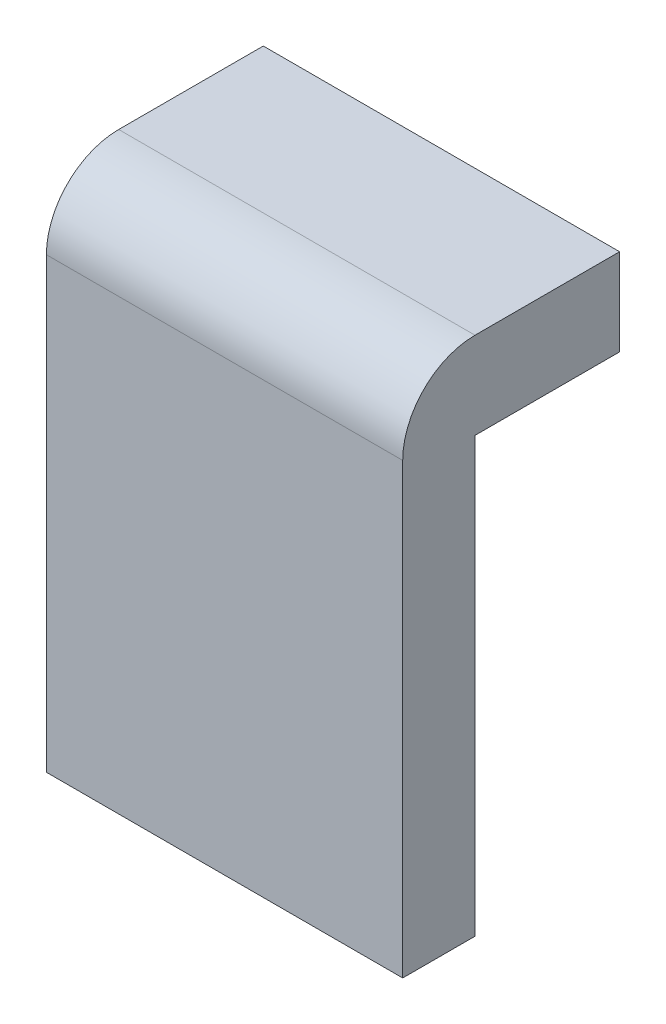
ISO-10303-21;
HEADER;
FILE_DESCRIPTION(('STEP AP214'),'2;1');
FILE_NAME('part.step','',(''),(''),'','','');
FILE_SCHEMA(('AUTOMOTIVE_DESIGN { 1 0 10303 214 1 1 1 1 }'));
ENDSEC;
DATA;
#1=APPLICATION_CONTEXT('core data for automotive mechanical design processes');
#2=APPLICATION_PROTOCOL_DEFINITION('international standard','automotive_design',2000,#1);
#3=PRODUCT_CONTEXT('',#1,'mechanical');
#4=PRODUCT('Part','Part','',(#3));
#5=PRODUCT_RELATED_PRODUCT_CATEGORY('part','',(#4));
#6=PRODUCT_DEFINITION_FORMATION('','',#4);
#7=PRODUCT_DEFINITION_CONTEXT('part definition',#1,'design');
#8=PRODUCT_DEFINITION('design','',#6,#7);
#9=PRODUCT_DEFINITION_SHAPE('','',#8);
#10=(LENGTH_UNIT() NAMED_UNIT(*) SI_UNIT(.MILLI.,.METRE.));
#11=(NAMED_UNIT(*) PLANE_ANGLE_UNIT() SI_UNIT($,.RADIAN.));
#12=(NAMED_UNIT(*) SI_UNIT($,.STERADIAN.) SOLID_ANGLE_UNIT());
#13=UNCERTAINTY_MEASURE_WITH_UNIT(LENGTH_MEASURE(1.E-05),#10,'distance_accuracy_value','');
#14=(GEOMETRIC_REPRESENTATION_CONTEXT(3) GLOBAL_UNCERTAINTY_ASSIGNED_CONTEXT((#13)) GLOBAL_UNIT_ASSIGNED_CONTEXT((#10,
#11,#12)) REPRESENTATION_CONTEXT('',''));
#15=CARTESIAN_POINT('',(0.,0.,0.));
#16=DIRECTION('',(0.,0.,1.));
#17=DIRECTION('',(1.,0.,0.));
#18=AXIS2_PLACEMENT_3D('',#15,#16,#17);
#19=CARTESIAN_POINT('',(-8.34906661620967,8.30000000000001,12.2546737770755));
#20=DIRECTION('',(0.,0.,1.));
#21=DIRECTION('',(0.,-1.,0.));
#22=AXIS2_PLACEMENT_3D('',#19,#20,#21);
#23=PLANE('',#22);
#24=DIRECTION('',(1.,0.,0.));
#25=VECTOR('',#24,1.);
#26=CARTESIAN_POINT('',(-15.8147962412963,6.80000000000003,12.2546737770755));
#27=LINE('',#26,#25);
#28=CARTESIAN_POINT('',(9.16373951271684,6.80000000000003,12.2546737770755));
#29=VERTEX_POINT('',#28);
#30=CARTESIAN_POINT('',(10.3958902691576,6.80000000000003,12.2546737770755));
#31=VERTEX_POINT('',#30);
#32=EDGE_CURVE('E113',#29,#31,#27,.T.);
#33=ORIENTED_EDGE('',*,*,#32,.F.);
#34=DIRECTION('',(0.,1.,0.));
#35=VECTOR('',#34,1.);
#36=CARTESIAN_POINT('',(9.16373951271684,5.35753839337147,12.2546737770755));
#37=LINE('',#36,#35);
#38=CARTESIAN_POINT('',(9.16373951271684,8.30000000000001,12.2546737770755));
#39=VERTEX_POINT('',#38);
#40=EDGE_CURVE('E148',#39,#29,#37,.F.);
#41=ORIENTED_EDGE('',*,*,#40,.F.);
#42=DIRECTION('',(1.,0.,0.));
#43=VECTOR('',#42,1.);
#44=CARTESIAN_POINT('',(-8.34906661620967,8.30000000000001,12.2546737770755));
#45=LINE('',#44,#43);
#46=CARTESIAN_POINT('',(10.3958902691576,8.30000000000001,12.2546737770755));
#47=VERTEX_POINT('',#46);
#48=EDGE_CURVE('E133',#39,#47,#45,.T.);
#49=ORIENTED_EDGE('',*,*,#48,.T.);
#50=DIRECTION('',(0.,1.,0.));
#51=VECTOR('',#50,1.);
#52=CARTESIAN_POINT('',(10.3958902691576,5.35753839337147,12.2546737770755));
#53=LINE('',#52,#51);
#54=EDGE_CURVE('E105',#31,#47,#53,.T.);
#55=ORIENTED_EDGE('',*,*,#54,.F.);
#56=EDGE_LOOP('',(#33,#41,#49,#55));
#57=FACE_BOUND('',#56,.T.);
#58=ADVANCED_FACE('F17',(#57),#23,.F.);
#59=CARTESIAN_POINT('',(-8.34906661620967,8.30000000000001,11.7546737770755));
#60=DIRECTION('',(0.,1.,0.));
#61=DIRECTION('',(0.,0.,1.));
#62=AXIS2_PLACEMENT_3D('',#59,#60,#61);
#63=PLANE('',#62);
#64=ORIENTED_EDGE('',*,*,#48,.F.);
#65=DIRECTION('',(0.,0.,1.));
#66=VECTOR('',#65,1.);
#67=CARTESIAN_POINT('',(9.16373951271684,8.30000000000001,12.5046737770755));
#68=LINE('',#67,#66);
#69=CARTESIAN_POINT('',(9.16373951271684,8.30000000000001,11.7546737770755));
#70=VERTEX_POINT('',#69);
#71=EDGE_CURVE('E153',#70,#39,#68,.T.);
#72=ORIENTED_EDGE('',*,*,#71,.F.);
#73=DIRECTION('',(1.,0.,0.));
#74=VECTOR('',#73,1.);
#75=CARTESIAN_POINT('',(9.16373951271684,8.30000000000001,11.7546737770755));
#76=LINE('',#75,#74);
#77=CARTESIAN_POINT('',(10.3958902691576,8.30000000000001,11.7546737770755));
#78=VERTEX_POINT('',#77);
#79=EDGE_CURVE('E124',#78,#70,#76,.F.);
#80=ORIENTED_EDGE('',*,*,#79,.F.);
#81=DIRECTION('',(0.,0.,-1.));
#82=VECTOR('',#81,1.);
#83=CARTESIAN_POINT('',(10.3958902691576,8.30000000000001,12.5046737770755));
#84=LINE('',#83,#82);
#85=EDGE_CURVE('E129',#47,#78,#84,.T.);
#86=ORIENTED_EDGE('',*,*,#85,.F.);
#87=EDGE_LOOP('',(#64,#72,#80,#86));
#88=FACE_BOUND('',#87,.T.);
#89=ADVANCED_FACE('F175',(#88),#63,.F.);
#90=CARTESIAN_POINT('',(9.16373951271684,5.35753839337146,11.7546737770755));
#91=DIRECTION('',(0.,0.,-1.));
#92=DIRECTION('',(0.,1.,0.));
#93=AXIS2_PLACEMENT_3D('',#90,#91,#92);
#94=PLANE('',#93);
#95=ORIENTED_EDGE('',*,*,#79,.T.);
#96=DIRECTION('',(0.,1.,0.));
#97=VECTOR('',#96,1.);
#98=CARTESIAN_POINT('',(9.16373951271684,5.35753839337147,11.7546737770755));
#99=LINE('',#98,#97);
#100=CARTESIAN_POINT('',(9.16373951271684,8.6,11.7546737770755));
#101=VERTEX_POINT('',#100);
#102=EDGE_CURVE('E119',#101,#70,#99,.F.);
#103=ORIENTED_EDGE('',*,*,#102,.F.);
#104=DIRECTION('',(1.,0.,0.));
#105=VECTOR('',#104,1.);
#106=CARTESIAN_POINT('',(-8.34906661620967,8.6,11.7546737770755));
#107=LINE('',#106,#105);
#108=CARTESIAN_POINT('',(10.3958902691576,8.6,11.7546737770755));
#109=VERTEX_POINT('',#108);
#110=EDGE_CURVE('E122',#101,#109,#107,.T.);
#111=ORIENTED_EDGE('',*,*,#110,.T.);
#112=DIRECTION('',(0.,1.,0.));
#113=VECTOR('',#112,1.);
#114=CARTESIAN_POINT('',(10.3958902691576,5.35753839337147,11.7546737770755));
#115=LINE('',#114,#113);
#116=EDGE_CURVE('E97',#78,#109,#115,.T.);
#117=ORIENTED_EDGE('',*,*,#116,.F.);
#118=EDGE_LOOP('',(#95,#103,#111,#117));
#119=FACE_BOUND('',#118,.T.);
#120=ADVANCED_FACE('F172',(#119),#94,.T.);
#121=CARTESIAN_POINT('',(-8.34906661620967,8.6,11.7546737770755));
#122=DIRECTION('',(0.,-1.,0.));
#123=DIRECTION('',(0.,0.,-1.));
#124=AXIS2_PLACEMENT_3D('',#121,#122,#123);
#125=PLANE('',#124);
#126=ORIENTED_EDGE('',*,*,#110,.F.);
#127=DIRECTION('',(0.,0.,1.));
#128=VECTOR('',#127,1.);
#129=CARTESIAN_POINT('',(9.16373951271684,8.6,12.5046737770755));
#130=LINE('',#129,#128);
#131=CARTESIAN_POINT('',(9.16373951271684,8.6,12.2546737770755));
#132=VERTEX_POINT('',#131);
#133=EDGE_CURVE('E83',#132,#101,#130,.F.);
#134=ORIENTED_EDGE('',*,*,#133,.F.);
#135=DIRECTION('',(1.,0.,0.));
#136=VECTOR('',#135,1.);
#137=CARTESIAN_POINT('',(-8.34906661620967,8.6,12.2546737770755));
#138=LINE('',#137,#136);
#139=CARTESIAN_POINT('',(10.3958902691576,8.6,12.2546737770755));
#140=VERTEX_POINT('',#139);
#141=EDGE_CURVE('E79',#140,#132,#138,.F.);
#142=ORIENTED_EDGE('',*,*,#141,.F.);
#143=DIRECTION('',(0.,0.,-1.));
#144=VECTOR('',#143,1.);
#145=CARTESIAN_POINT('',(10.3958902691576,8.6,12.5046737770755));
#146=LINE('',#145,#144);
#147=EDGE_CURVE('E94',#109,#140,#146,.F.);
#148=ORIENTED_EDGE('',*,*,#147,.F.);
#149=EDGE_LOOP('',(#126,#134,#142,#148));
#150=FACE_BOUND('',#149,.T.);
#151=ADVANCED_FACE('F168',(#150),#125,.F.);
#152=CARTESIAN_POINT('',(-8.34906661620967,8.35,12.2546737770755));
#153=DIRECTION('',(1.,0.,0.));
#154=DIRECTION('',(0.,0.,-1.));
#155=AXIS2_PLACEMENT_3D('',#152,#153,#154);
#156=CYLINDRICAL_SURFACE('',#155,0.249999999999995);
#157=CARTESIAN_POINT('',(9.16373951271684,8.35,12.2546737770755));
#158=DIRECTION('',(1.,0.,0.));
#159=DIRECTION('',(0.,0.,-1.));
#160=AXIS2_PLACEMENT_3D('',#157,#158,#159);
#161=CIRCLE('',#160,0.249999999999995);
#162=CARTESIAN_POINT('',(9.16373951271684,8.35,12.5046737770755));
#163=VERTEX_POINT('',#162);
#164=EDGE_CURVE('E20',#163,#132,#161,.F.);
#165=ORIENTED_EDGE('',*,*,#164,.F.);
#166=DIRECTION('',(1.,0.,0.));
#167=VECTOR('',#166,1.);
#168=CARTESIAN_POINT('',(9.16373951271684,8.35,12.5046737770755));
#169=LINE('',#168,#167);
#170=CARTESIAN_POINT('',(10.3958902691576,8.35,12.5046737770755));
#171=VERTEX_POINT('',#170);
#172=EDGE_CURVE('E77',#171,#163,#169,.F.);
#173=ORIENTED_EDGE('',*,*,#172,.F.);
#174=CARTESIAN_POINT('',(10.3958902691576,8.35,12.2546737770755));
#175=DIRECTION('',(1.,0.,0.));
#176=DIRECTION('',(0.,0.,-1.));
#177=AXIS2_PLACEMENT_3D('',#174,#175,#176);
#178=CIRCLE('',#177,0.249999999999995);
#179=EDGE_CURVE('E106',#140,#171,#178,.T.);
#180=ORIENTED_EDGE('',*,*,#179,.F.);
#181=ORIENTED_EDGE('',*,*,#141,.T.);
#182=EDGE_LOOP('',(#165,#173,#180,#181));
#183=FACE_BOUND('',#182,.T.);
#184=ADVANCED_FACE('F74',(#183),#156,.T.);
#185=CARTESIAN_POINT('',(9.16373951271684,5.35753839337147,12.5046737770755));
#186=DIRECTION('',(-1.,0.,0.));
#187=DIRECTION('',(0.,0.,1.));
#188=AXIS2_PLACEMENT_3D('',#185,#186,#187);
#189=PLANE('',#188);
#190=DIRECTION('',(0.,0.,-1.));
#191=VECTOR('',#190,1.);
#192=CARTESIAN_POINT('',(9.16373951271684,6.80000000000003,12.5046737770755));
#193=LINE('',#192,#191);
#194=CARTESIAN_POINT('',(9.16373951271684,6.80000000000003,12.5046737770755));
#195=VERTEX_POINT('',#194);
#196=EDGE_CURVE('E89',#195,#29,#193,.T.);
#197=ORIENTED_EDGE('',*,*,#196,.F.);
#198=DIRECTION('',(0.,-1.,0.));
#199=VECTOR('',#198,1.);
#200=CARTESIAN_POINT('',(9.16373951271684,5.35753839337147,12.5046737770755));
#201=LINE('',#200,#199);
#202=EDGE_CURVE('E85',#163,#195,#201,.T.);
#203=ORIENTED_EDGE('',*,*,#202,.F.);
#204=ORIENTED_EDGE('',*,*,#164,.T.);
#205=ORIENTED_EDGE('',*,*,#133,.T.);
#206=ORIENTED_EDGE('',*,*,#102,.T.);
#207=ORIENTED_EDGE('',*,*,#71,.T.);
#208=ORIENTED_EDGE('',*,*,#40,.T.);
#209=EDGE_LOOP('',(#197,#203,#204,#205,#206,#207,#208));
#210=FACE_BOUND('',#209,.T.);
#211=ADVANCED_FACE('F86',(#210),#189,.T.);
#212=CARTESIAN_POINT('',(-15.8147962412963,6.80000000000003,12.5046737770755));
#213=DIRECTION('',(0.,-1.,0.));
#214=DIRECTION('',(0.,0.,-1.));
#215=AXIS2_PLACEMENT_3D('',#212,#213,#214);
#216=PLANE('',#215);
#217=DIRECTION('',(1.,0.,0.));
#218=VECTOR('',#217,1.);
#219=CARTESIAN_POINT('',(9.16373951271684,6.80000000000003,12.5046737770755));
#220=LINE('',#219,#218);
#221=CARTESIAN_POINT('',(10.3958902691576,6.80000000000003,12.5046737770755));
#222=VERTEX_POINT('',#221);
#223=EDGE_CURVE('E26',#195,#222,#220,.T.);
#224=ORIENTED_EDGE('',*,*,#223,.F.);
#225=ORIENTED_EDGE('',*,*,#196,.T.);
#226=ORIENTED_EDGE('',*,*,#32,.T.);
#227=DIRECTION('',(0.,0.,-1.));
#228=VECTOR('',#227,1.);
#229=CARTESIAN_POINT('',(10.3958902691576,6.80000000000003,12.5046737770755));
#230=LINE('',#229,#228);
#231=EDGE_CURVE('E35',#222,#31,#230,.T.);
#232=ORIENTED_EDGE('',*,*,#231,.F.);
#233=EDGE_LOOP('',(#224,#225,#226,#232));
#234=FACE_BOUND('',#233,.T.);
#235=ADVANCED_FACE('F179',(#234),#216,.T.);
#236=CARTESIAN_POINT('',(10.3958902691576,5.35753839337147,12.5046737770755));
#237=DIRECTION('',(1.,0.,0.));
#238=DIRECTION('',(0.,0.,-1.));
#239=AXIS2_PLACEMENT_3D('',#236,#237,#238);
#240=PLANE('',#239);
#241=ORIENTED_EDGE('',*,*,#116,.T.);
#242=ORIENTED_EDGE('',*,*,#147,.T.);
#243=ORIENTED_EDGE('',*,*,#179,.T.);
#244=DIRECTION('',(0.,-1.,0.));
#245=VECTOR('',#244,1.);
#246=CARTESIAN_POINT('',(10.3958902691576,5.35753839337147,12.5046737770755));
#247=LINE('',#246,#245);
#248=EDGE_CURVE('E11',#222,#171,#247,.F.);
#249=ORIENTED_EDGE('',*,*,#248,.F.);
#250=ORIENTED_EDGE('',*,*,#231,.T.);
#251=ORIENTED_EDGE('',*,*,#54,.T.);
#252=ORIENTED_EDGE('',*,*,#85,.T.);
#253=EDGE_LOOP('',(#241,#242,#243,#249,#250,#251,#252));
#254=FACE_BOUND('',#253,.T.);
#255=ADVANCED_FACE('F164',(#254),#240,.T.);
#256=CARTESIAN_POINT('',(9.16373951271684,5.35753839337147,12.5046737770755));
#257=DIRECTION('',(0.,0.,1.));
#258=DIRECTION('',(0.,-1.,0.));
#259=AXIS2_PLACEMENT_3D('',#256,#257,#258);
#260=PLANE('',#259);
#261=ORIENTED_EDGE('',*,*,#223,.T.);
#262=ORIENTED_EDGE('',*,*,#248,.T.);
#263=ORIENTED_EDGE('',*,*,#172,.T.);
#264=ORIENTED_EDGE('',*,*,#202,.T.);
#265=EDGE_LOOP('',(#261,#262,#263,#264));
#266=FACE_BOUND('',#265,.T.);
#267=ADVANCED_FACE('F93',(#266),#260,.T.);
#268=CLOSED_SHELL('',(#58,#89,#120,#151,#184,#211,#235,#255,#267));
#269=MANIFOLD_SOLID_BREP('B1',#268);
#270=ADVANCED_BREP_SHAPE_REPRESENTATION('',(#18,#269),#14);
#271=SHAPE_DEFINITION_REPRESENTATION(#9,#270);
ENDSEC;
END-ISO-10303-21;
